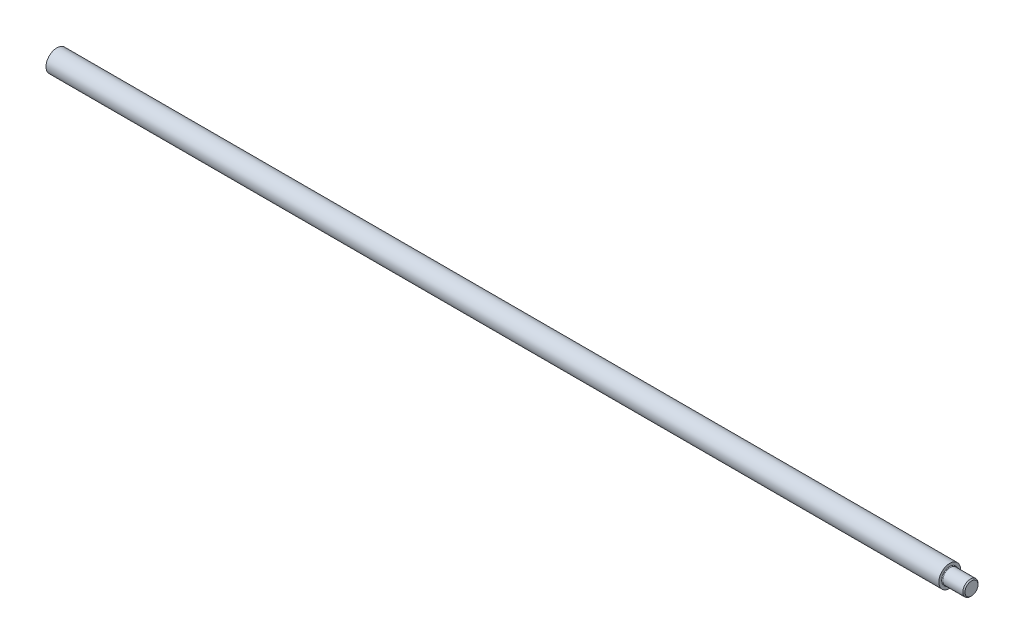
ISO-10303-21;
HEADER;
FILE_DESCRIPTION(('STEP AP214'),'2;1');
FILE_NAME('part.step','',(''),(''),'','','');
FILE_SCHEMA(('AUTOMOTIVE_DESIGN { 1 0 10303 214 1 1 1 1 }'));
ENDSEC;
DATA;
#1=APPLICATION_CONTEXT('core data for automotive mechanical design processes');
#2=APPLICATION_PROTOCOL_DEFINITION('international standard','automotive_design',2000,#1);
#3=PRODUCT_CONTEXT('',#1,'mechanical');
#4=PRODUCT('Part','Part','',(#3));
#5=PRODUCT_RELATED_PRODUCT_CATEGORY('part','',(#4));
#6=PRODUCT_DEFINITION_FORMATION('','',#4);
#7=PRODUCT_DEFINITION_CONTEXT('part definition',#1,'design');
#8=PRODUCT_DEFINITION('design','',#6,#7);
#9=PRODUCT_DEFINITION_SHAPE('','',#8);
#10=(LENGTH_UNIT() NAMED_UNIT(*) SI_UNIT(.MILLI.,.METRE.));
#11=(NAMED_UNIT(*) PLANE_ANGLE_UNIT() SI_UNIT($,.RADIAN.));
#12=(NAMED_UNIT(*) SI_UNIT($,.STERADIAN.) SOLID_ANGLE_UNIT());
#13=UNCERTAINTY_MEASURE_WITH_UNIT(LENGTH_MEASURE(1.E-05),#10,'distance_accuracy_value','');
#14=(GEOMETRIC_REPRESENTATION_CONTEXT(3) GLOBAL_UNCERTAINTY_ASSIGNED_CONTEXT((#13)) GLOBAL_UNIT_ASSIGNED_CONTEXT((#10,
#11,#12)) REPRESENTATION_CONTEXT('',''));
#15=CARTESIAN_POINT('',(0.,0.,0.));
#16=DIRECTION('',(0.,0.,1.));
#17=DIRECTION('',(1.,0.,0.));
#18=AXIS2_PLACEMENT_3D('',#15,#16,#17);
#19=CARTESIAN_POINT('',(490.,0.,0.));
#20=DIRECTION('',(1.,0.,0.));
#21=DIRECTION('',(0.,0.,1.));
#22=AXIS2_PLACEMENT_3D('',#19,#20,#21);
#23=CYLINDRICAL_SURFACE('',#22,5.);
#24=CARTESIAN_POINT('',(490.,0.,0.));
#25=DIRECTION('',(1.,0.,0.));
#26=DIRECTION('',(0.,-1.41721898572201E-07,0.99999999999999));
#27=AXIS2_PLACEMENT_3D('',#24,#25,#26);
#28=CIRCLE('',#27,5.);
#29=CARTESIAN_POINT('',(490.,-7.08609492861005E-07,4.99999999999995));
#30=VERTEX_POINT('',#29);
#31=EDGE_CURVE('E58',#30,#30,#28,.T.);
#32=ORIENTED_EDGE('',*,*,#31,.F.);
#33=EDGE_LOOP('',(#32));
#34=FACE_BOUND('',#33,.T.);
#35=CARTESIAN_POINT('',(79.4177500000306,0.,0.));
#36=DIRECTION('',(-1.,0.,0.));
#37=DIRECTION('',(0.,0.,1.));
#38=AXIS2_PLACEMENT_3D('',#35,#36,#37);
#39=CIRCLE('',#38,5.);
#40=CARTESIAN_POINT('',(79.4177500000306,0.,5.));
#41=VERTEX_POINT('',#40);
#42=EDGE_CURVE('E42',#41,#41,#39,.F.);
#43=ORIENTED_EDGE('',*,*,#42,.T.);
#44=EDGE_LOOP('',(#43));
#45=FACE_BOUND('',#44,.T.);
#46=ADVANCED_FACE('F38',(#34,#45),#23,.T.);
#47=CARTESIAN_POINT('',(490.,-4.99999975829996,-5.00000000000001));
#48=DIRECTION('',(1.,0.,0.));
#49=DIRECTION('',(0.,1.,0.));
#50=AXIS2_PLACEMENT_3D('',#47,#48,#49);
#51=PLANE('',#50);
#52=ORIENTED_EDGE('',*,*,#31,.T.);
#53=EDGE_LOOP('',(#52));
#54=FACE_BOUND('',#53,.T.);
#55=CARTESIAN_POINT('',(490.,0.,0.));
#56=DIRECTION('',(-1.,0.,0.));
#57=DIRECTION('',(0.,0.,-1.));
#58=AXIS2_PLACEMENT_3D('',#55,#56,#57);
#59=CIRCLE('',#58,3.80000037178537);
#60=CARTESIAN_POINT('',(490.,0.,-3.80000037178537));
#61=VERTEX_POINT('',#60);
#62=EDGE_CURVE('E55',#61,#61,#59,.F.);
#63=ORIENTED_EDGE('',*,*,#62,.F.);
#64=EDGE_LOOP('',(#63));
#65=FACE_BOUND('',#64,.T.);
#66=ADVANCED_FACE('F77',(#54,#65),#51,.T.);
#67=CARTESIAN_POINT('',(500.,-2.99999985477205,-2.9999999999999));
#68=DIRECTION('',(1.,0.,0.));
#69=DIRECTION('',(0.,1.,0.));
#70=AXIS2_PLACEMENT_3D('',#67,#68,#69);
#71=PLANE('',#70);
#72=CARTESIAN_POINT('',(500.,0.,0.));
#73=DIRECTION('',(1.,0.,0.));
#74=DIRECTION('',(0.,-1.41924996939959E-07,0.99999999999999));
#75=AXIS2_PLACEMENT_3D('',#72,#73,#74);
#76=CIRCLE('',#75,2.9999999999999);
#77=CARTESIAN_POINT('',(500.,-4.25774990819863E-07,2.99999999999987));
#78=VERTEX_POINT('',#77);
#79=EDGE_CURVE('E50',#78,#78,#76,.T.);
#80=ORIENTED_EDGE('',*,*,#79,.T.);
#81=EDGE_LOOP('',(#80));
#82=FACE_BOUND('',#81,.T.);
#83=ADVANCED_FACE('F83',(#82),#71,.T.);
#84=CARTESIAN_POINT('',(490.299999999993,0.,0.));
#85=DIRECTION('',(1.,0.,0.));
#86=DIRECTION('',(0.,0.,1.));
#87=AXIS2_PLACEMENT_3D('',#84,#85,#86);
#88=TOROIDAL_SURFACE('',#87,3.79999999999319,0.29999999999325);
#89=CARTESIAN_POINT('',(490.3,0.,0.));
#90=DIRECTION('',(-1.,0.,0.));
#91=DIRECTION('',(0.,0.,-1.));
#92=AXIS2_PLACEMENT_3D('',#89,#90,#91);
#93=CIRCLE('',#92,3.49999999999994);
#94=CARTESIAN_POINT('',(490.3,0.,-3.49999999999994));
#95=VERTEX_POINT('',#94);
#96=EDGE_CURVE('E46',#95,#95,#93,.F.);
#97=ORIENTED_EDGE('',*,*,#96,.F.);
#98=EDGE_LOOP('',(#97));
#99=FACE_BOUND('',#98,.T.);
#100=ORIENTED_EDGE('',*,*,#62,.T.);
#101=EDGE_LOOP('',(#100));
#102=FACE_BOUND('',#101,.T.);
#103=ADVANCED_FACE('F86',(#99,#102),#88,.F.);
#104=CARTESIAN_POINT('',(500.,0.,0.));
#105=DIRECTION('',(1.,0.,0.));
#106=DIRECTION('',(0.,0.,1.));
#107=AXIS2_PLACEMENT_3D('',#104,#105,#106);
#108=CYLINDRICAL_SURFACE('',#107,3.49999999999992);
#109=CARTESIAN_POINT('',(499.5,0.,0.));
#110=DIRECTION('',(-1.,0.,0.));
#111=DIRECTION('',(0.,0.,-1.));
#112=AXIS2_PLACEMENT_3D('',#109,#110,#111);
#113=CIRCLE('',#112,3.49999999999992);
#114=CARTESIAN_POINT('',(499.5,0.,-3.49999999999992));
#115=VERTEX_POINT('',#114);
#116=EDGE_CURVE('E10',#115,#115,#113,.F.);
#117=ORIENTED_EDGE('',*,*,#116,.F.);
#118=EDGE_LOOP('',(#117));
#119=FACE_BOUND('',#118,.T.);
#120=ORIENTED_EDGE('',*,*,#96,.T.);
#121=EDGE_LOOP('',(#120));
#122=FACE_BOUND('',#121,.T.);
#123=ADVANCED_FACE('F73',(#119,#122),#108,.T.);
#124=CARTESIAN_POINT('',(499.5,0.,0.));
#125=DIRECTION('',(-1.,0.,0.));
#126=DIRECTION('',(0.,0.,-1.));
#127=AXIS2_PLACEMENT_3D('',#124,#125,#126);
#128=CONICAL_SURFACE('',#127,3.4999999999999,0.785398163397447);
#129=ORIENTED_EDGE('',*,*,#79,.F.);
#130=EDGE_LOOP('',(#129));
#131=FACE_BOUND('',#130,.T.);
#132=ORIENTED_EDGE('',*,*,#116,.T.);
#133=EDGE_LOOP('',(#132));
#134=FACE_BOUND('',#133,.T.);
#135=ADVANCED_FACE('F40',(#131,#134),#128,.T.);
#136=CARTESIAN_POINT('',(79.4177500000306,20.,-19.5090470468525));
#137=DIRECTION('',(-1.,0.,0.));
#138=DIRECTION('',(0.,0.,1.));
#139=AXIS2_PLACEMENT_3D('',#136,#137,#138);
#140=PLANE('',#139);
#141=ORIENTED_EDGE('',*,*,#42,.F.);
#142=EDGE_LOOP('',(#141));
#143=FACE_BOUND('',#142,.T.);
#144=ADVANCED_FACE('F66',(#143),#140,.T.);
#145=CLOSED_SHELL('',(#46,#66,#83,#103,#123,#135,#144));
#146=MANIFOLD_SOLID_BREP('B2',#145);
#147=ADVANCED_BREP_SHAPE_REPRESENTATION('',(#18,#146),#14);
#148=SHAPE_DEFINITION_REPRESENTATION(#9,#147);
ENDSEC;
END-ISO-10303-21;
